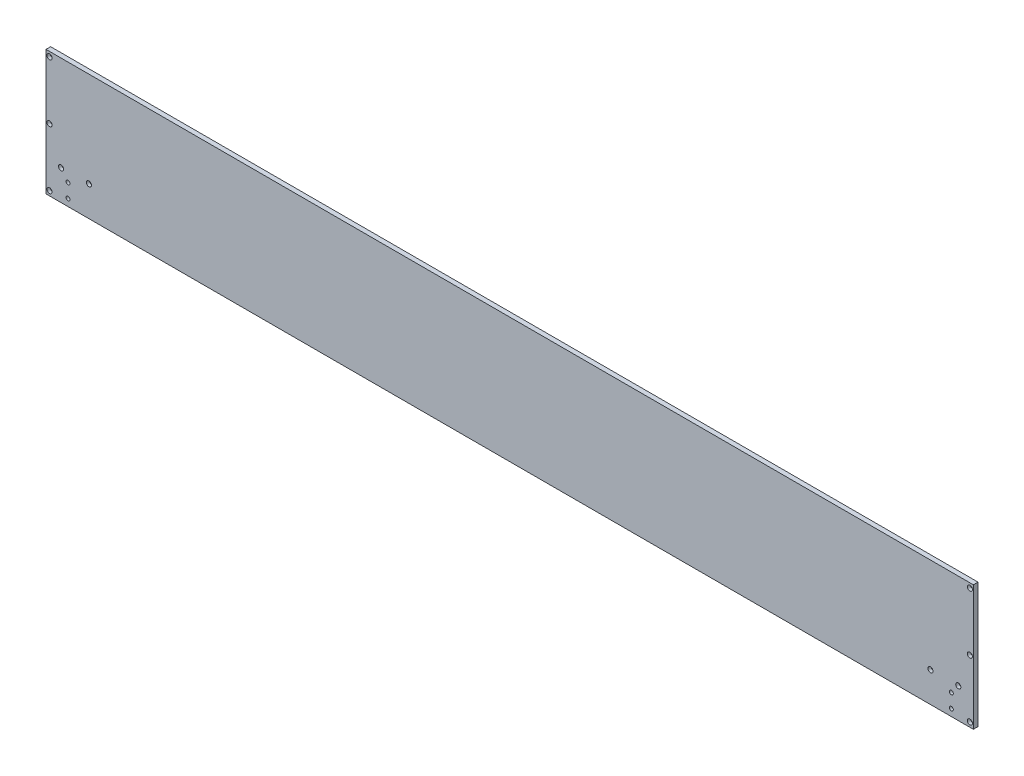
ISO-10303-21;
HEADER;
FILE_DESCRIPTION(('STEP AP214'),'2;1');
FILE_NAME('part.step','',(''),(''),'','','');
FILE_SCHEMA(('AUTOMOTIVE_DESIGN { 1 0 10303 214 1 1 1 1 }'));
ENDSEC;
DATA;
#1=APPLICATION_CONTEXT('core data for automotive mechanical design processes');
#2=APPLICATION_PROTOCOL_DEFINITION('international standard','automotive_design',2000,#1);
#3=PRODUCT_CONTEXT('',#1,'mechanical');
#4=PRODUCT('Part','Part','',(#3));
#5=PRODUCT_RELATED_PRODUCT_CATEGORY('part','',(#4));
#6=PRODUCT_DEFINITION_FORMATION('','',#4);
#7=PRODUCT_DEFINITION_CONTEXT('part definition',#1,'design');
#8=PRODUCT_DEFINITION('design','',#6,#7);
#9=PRODUCT_DEFINITION_SHAPE('','',#8);
#10=(LENGTH_UNIT() NAMED_UNIT(*) SI_UNIT(.MILLI.,.METRE.));
#11=(NAMED_UNIT(*) PLANE_ANGLE_UNIT() SI_UNIT($,.RADIAN.));
#12=(NAMED_UNIT(*) SI_UNIT($,.STERADIAN.) SOLID_ANGLE_UNIT());
#13=UNCERTAINTY_MEASURE_WITH_UNIT(LENGTH_MEASURE(1.E-05),#10,'distance_accuracy_value','');
#14=(GEOMETRIC_REPRESENTATION_CONTEXT(3) GLOBAL_UNCERTAINTY_ASSIGNED_CONTEXT((#13)) GLOBAL_UNIT_ASSIGNED_CONTEXT((#10,
#11,#12)) REPRESENTATION_CONTEXT('',''));
#15=CARTESIAN_POINT('',(0.,0.,0.));
#16=DIRECTION('',(0.,0.,1.));
#17=DIRECTION('',(1.,0.,0.));
#18=AXIS2_PLACEMENT_3D('',#15,#16,#17);
#19=CARTESIAN_POINT('',(0.,0.,5.));
#20=DIRECTION('',(0.,0.,-1.));
#21=DIRECTION('',(-1.,0.,0.));
#22=AXIS2_PLACEMENT_3D('',#19,#20,#21);
#23=PLANE('',#22);
#24=CARTESIAN_POINT('',(-967.5,-70.,5.));
#25=DIRECTION('',(0.,0.,1.));
#26=DIRECTION('',(1.,0.,0.));
#27=AXIS2_PLACEMENT_3D('',#24,#25,#26);
#28=CIRCLE('',#27,5.49999999999995);
#29=CARTESIAN_POINT('',(-962.,-70.,5.));
#30=VERTEX_POINT('',#29);
#31=EDGE_CURVE('E245',#30,#30,#28,.T.);
#32=ORIENTED_EDGE('',*,*,#31,.F.);
#33=EDGE_LOOP('',(#32));
#34=FACE_BOUND('',#33,.T.);
#35=CARTESIAN_POINT('',(907.5,-70.,5.));
#36=DIRECTION('',(0.,0.,1.));
#37=DIRECTION('',(1.,0.,0.));
#38=AXIS2_PLACEMENT_3D('',#35,#36,#37);
#39=CIRCLE('',#38,5.49999999999995);
#40=CARTESIAN_POINT('',(913.,-70.,5.));
#41=VERTEX_POINT('',#40);
#42=EDGE_CURVE('E233',#41,#41,#39,.T.);
#43=ORIENTED_EDGE('',*,*,#42,.F.);
#44=EDGE_LOOP('',(#43));
#45=FACE_BOUND('',#44,.T.);
#46=CARTESIAN_POINT('',(967.5,-70.,5.));
#47=DIRECTION('',(0.,0.,1.));
#48=DIRECTION('',(1.,0.,0.));
#49=AXIS2_PLACEMENT_3D('',#46,#47,#48);
#50=CIRCLE('',#49,5.49999999999995);
#51=CARTESIAN_POINT('',(973.,-70.,5.));
#52=VERTEX_POINT('',#51);
#53=EDGE_CURVE('E221',#52,#52,#50,.T.);
#54=ORIENTED_EDGE('',*,*,#53,.F.);
#55=EDGE_LOOP('',(#54));
#56=FACE_BOUND('',#55,.T.);
#57=CARTESIAN_POINT('',(952.5,-120.,5.));
#58=DIRECTION('',(0.,0.,1.));
#59=DIRECTION('',(1.,0.,0.));
#60=AXIS2_PLACEMENT_3D('',#57,#58,#59);
#61=CIRCLE('',#60,4.24999999999998);
#62=CARTESIAN_POINT('',(956.75,-120.,5.));
#63=VERTEX_POINT('',#62);
#64=EDGE_CURVE('E203',#63,#63,#61,.T.);
#65=ORIENTED_EDGE('',*,*,#64,.F.);
#66=EDGE_LOOP('',(#65));
#67=FACE_BOUND('',#66,.T.);
#68=CARTESIAN_POINT('',(-952.5,-90.,5.));
#69=DIRECTION('',(0.,0.,1.));
#70=DIRECTION('',(1.,0.,0.));
#71=AXIS2_PLACEMENT_3D('',#68,#69,#70);
#72=CIRCLE('',#71,4.24999999999998);
#73=CARTESIAN_POINT('',(-948.25,-90.,5.));
#74=VERTEX_POINT('',#73);
#75=EDGE_CURVE('E197',#74,#74,#72,.T.);
#76=ORIENTED_EDGE('',*,*,#75,.F.);
#77=EDGE_LOOP('',(#76));
#78=FACE_BOUND('',#77,.T.);
#79=CARTESIAN_POINT('',(-952.5,-120.,5.));
#80=DIRECTION('',(0.,0.,1.));
#81=DIRECTION('',(1.,0.,0.));
#82=AXIS2_PLACEMENT_3D('',#79,#80,#81);
#83=CIRCLE('',#82,4.24999999999998);
#84=CARTESIAN_POINT('',(-948.25,-120.,5.));
#85=VERTEX_POINT('',#84);
#86=EDGE_CURVE('E191',#85,#85,#83,.T.);
#87=ORIENTED_EDGE('',*,*,#86,.F.);
#88=EDGE_LOOP('',(#87));
#89=FACE_BOUND('',#88,.T.);
#90=CARTESIAN_POINT('',(-992.5,125.,5.));
#91=DIRECTION('',(0.,0.,1.));
#92=DIRECTION('',(1.,0.,0.));
#93=AXIS2_PLACEMENT_3D('',#90,#91,#92);
#94=CIRCLE('',#93,5.49999999999995);
#95=CARTESIAN_POINT('',(-987.,125.,5.));
#96=VERTEX_POINT('',#95);
#97=EDGE_CURVE('E185',#96,#96,#94,.T.);
#98=ORIENTED_EDGE('',*,*,#97,.F.);
#99=EDGE_LOOP('',(#98));
#100=FACE_BOUND('',#99,.T.);
#101=CARTESIAN_POINT('',(-992.5,-125.,5.));
#102=DIRECTION('',(0.,0.,1.));
#103=DIRECTION('',(1.,0.,0.));
#104=AXIS2_PLACEMENT_3D('',#101,#102,#103);
#105=CIRCLE('',#104,5.49999999999995);
#106=CARTESIAN_POINT('',(-987.,-125.,5.));
#107=VERTEX_POINT('',#106);
#108=EDGE_CURVE('E173',#107,#107,#105,.T.);
#109=ORIENTED_EDGE('',*,*,#108,.F.);
#110=EDGE_LOOP('',(#109));
#111=FACE_BOUND('',#110,.T.);
#112=CARTESIAN_POINT('',(992.5,125.,5.));
#113=DIRECTION('',(0.,0.,1.));
#114=DIRECTION('',(1.,0.,0.));
#115=AXIS2_PLACEMENT_3D('',#112,#113,#114);
#116=CIRCLE('',#115,5.49999999999995);
#117=CARTESIAN_POINT('',(998.,125.,5.));
#118=VERTEX_POINT('',#117);
#119=EDGE_CURVE('E161',#118,#118,#116,.T.);
#120=ORIENTED_EDGE('',*,*,#119,.F.);
#121=EDGE_LOOP('',(#120));
#122=FACE_BOUND('',#121,.T.);
#123=CARTESIAN_POINT('',(992.5,-125.,5.));
#124=DIRECTION('',(0.,0.,1.));
#125=DIRECTION('',(1.,0.,0.));
#126=AXIS2_PLACEMENT_3D('',#123,#124,#125);
#127=CIRCLE('',#126,5.49999999999995);
#128=CARTESIAN_POINT('',(998.,-125.,5.));
#129=VERTEX_POINT('',#128);
#130=EDGE_CURVE('E149',#129,#129,#127,.T.);
#131=ORIENTED_EDGE('',*,*,#130,.F.);
#132=EDGE_LOOP('',(#131));
#133=FACE_BOUND('',#132,.T.);
#134=CARTESIAN_POINT('',(992.5,0.,5.));
#135=DIRECTION('',(0.,0.,1.));
#136=DIRECTION('',(1.,0.,0.));
#137=AXIS2_PLACEMENT_3D('',#134,#135,#136);
#138=CIRCLE('',#137,5.49999999999995);
#139=CARTESIAN_POINT('',(997.999999999999,0.,5.));
#140=VERTEX_POINT('',#139);
#141=EDGE_CURVE('E137',#140,#140,#138,.T.);
#142=ORIENTED_EDGE('',*,*,#141,.F.);
#143=EDGE_LOOP('',(#142));
#144=FACE_BOUND('',#143,.T.);
#145=CARTESIAN_POINT('',(-992.5,0.,5.));
#146=DIRECTION('',(0.,0.,1.));
#147=DIRECTION('',(1.,0.,0.));
#148=AXIS2_PLACEMENT_3D('',#145,#146,#147);
#149=CIRCLE('',#148,5.49999999999995);
#150=CARTESIAN_POINT('',(-987.,0.,5.));
#151=VERTEX_POINT('',#150);
#152=EDGE_CURVE('E125',#151,#151,#149,.T.);
#153=ORIENTED_EDGE('',*,*,#152,.F.);
#154=EDGE_LOOP('',(#153));
#155=FACE_BOUND('',#154,.T.);
#156=DIRECTION('',(0.,1.,0.));
#157=VECTOR('',#156,1.);
#158=CARTESIAN_POINT('',(1000.,-135.,5.));
#159=LINE('',#158,#157);
#160=CARTESIAN_POINT('',(1000.,-135.,5.));
#161=VERTEX_POINT('',#160);
#162=CARTESIAN_POINT('',(1000.,135.,5.));
#163=VERTEX_POINT('',#162);
#164=EDGE_CURVE('E90',#161,#163,#159,.T.);
#165=ORIENTED_EDGE('',*,*,#164,.T.);
#166=DIRECTION('',(-1.,0.,0.));
#167=VECTOR('',#166,1.);
#168=CARTESIAN_POINT('',(-1000.,135.,5.));
#169=LINE('',#168,#167);
#170=CARTESIAN_POINT('',(-1000.,135.,5.));
#171=VERTEX_POINT('',#170);
#172=EDGE_CURVE('E85',#163,#171,#169,.T.);
#173=ORIENTED_EDGE('',*,*,#172,.T.);
#174=DIRECTION('',(0.,-1.,0.));
#175=VECTOR('',#174,1.);
#176=CARTESIAN_POINT('',(-1000.,-135.,5.));
#177=LINE('',#176,#175);
#178=CARTESIAN_POINT('',(-1000.,-135.,5.));
#179=VERTEX_POINT('',#178);
#180=EDGE_CURVE('E88',#171,#179,#177,.T.);
#181=ORIENTED_EDGE('',*,*,#180,.T.);
#182=DIRECTION('',(1.,0.,0.));
#183=VECTOR('',#182,1.);
#184=CARTESIAN_POINT('',(-1000.,-135.,5.));
#185=LINE('',#184,#183);
#186=EDGE_CURVE('E55',#179,#161,#185,.T.);
#187=ORIENTED_EDGE('',*,*,#186,.T.);
#188=EDGE_LOOP('',(#165,#173,#181,#187));
#189=FACE_BOUND('',#188,.T.);
#190=CARTESIAN_POINT('',(952.5,-90.,5.));
#191=DIRECTION('',(0.,0.,1.));
#192=DIRECTION('',(1.,0.,0.));
#193=AXIS2_PLACEMENT_3D('',#190,#191,#192);
#194=CIRCLE('',#193,4.24999999999998);
#195=CARTESIAN_POINT('',(956.75,-90.,5.));
#196=VERTEX_POINT('',#195);
#197=EDGE_CURVE('E209',#196,#196,#194,.T.);
#198=ORIENTED_EDGE('',*,*,#197,.F.);
#199=EDGE_LOOP('',(#198));
#200=FACE_BOUND('',#199,.T.);
#201=CARTESIAN_POINT('',(-907.5,-70.,5.));
#202=DIRECTION('',(0.,0.,1.));
#203=DIRECTION('',(1.,0.,0.));
#204=AXIS2_PLACEMENT_3D('',#201,#202,#203);
#205=CIRCLE('',#204,5.49999999999995);
#206=CARTESIAN_POINT('',(-902.,-70.,5.));
#207=VERTEX_POINT('',#206);
#208=EDGE_CURVE('E257',#207,#207,#205,.T.);
#209=ORIENTED_EDGE('',*,*,#208,.F.);
#210=EDGE_LOOP('',(#209));
#211=FACE_BOUND('',#210,.T.);
#212=ADVANCED_FACE('F38',(#34,#45,#56,#67,#78,#89,#100,#111,#122,#133,#144,#155,#189,#200,#211),
#23,.F.);
#213=CARTESIAN_POINT('',(0.,0.,-5.));
#214=DIRECTION('',(0.,0.,-1.));
#215=DIRECTION('',(-1.,0.,0.));
#216=AXIS2_PLACEMENT_3D('',#213,#214,#215);
#217=PLANE('',#216);
#218=CARTESIAN_POINT('',(-907.5,-70.,-5.));
#219=DIRECTION('',(0.,0.,1.));
#220=DIRECTION('',(1.,0.,0.));
#221=AXIS2_PLACEMENT_3D('',#218,#219,#220);
#222=CIRCLE('',#221,3.29999999999997);
#223=CARTESIAN_POINT('',(-904.2,-70.,-5.));
#224=VERTEX_POINT('',#223);
#225=EDGE_CURVE('E248',#224,#224,#222,.T.);
#226=ORIENTED_EDGE('',*,*,#225,.T.);
#227=EDGE_LOOP('',(#226));
#228=FACE_BOUND('',#227,.T.);
#229=CARTESIAN_POINT('',(952.5,-120.,-5.));
#230=DIRECTION('',(0.,0.,1.));
#231=DIRECTION('',(1.,0.,0.));
#232=AXIS2_PLACEMENT_3D('',#229,#230,#231);
#233=CIRCLE('',#232,4.24999999999998);
#234=CARTESIAN_POINT('',(956.75,-120.,-5.));
#235=VERTEX_POINT('',#234);
#236=EDGE_CURVE('E200',#235,#235,#233,.T.);
#237=ORIENTED_EDGE('',*,*,#236,.T.);
#238=EDGE_LOOP('',(#237));
#239=FACE_BOUND('',#238,.T.);
#240=CARTESIAN_POINT('',(-952.5,-90.,-5.));
#241=DIRECTION('',(0.,0.,1.));
#242=DIRECTION('',(1.,0.,0.));
#243=AXIS2_PLACEMENT_3D('',#240,#241,#242);
#244=CIRCLE('',#243,4.24999999999998);
#245=CARTESIAN_POINT('',(-948.25,-90.,-5.));
#246=VERTEX_POINT('',#245);
#247=EDGE_CURVE('E194',#246,#246,#244,.T.);
#248=ORIENTED_EDGE('',*,*,#247,.T.);
#249=EDGE_LOOP('',(#248));
#250=FACE_BOUND('',#249,.T.);
#251=CARTESIAN_POINT('',(-952.5,-120.,-5.));
#252=DIRECTION('',(0.,0.,1.));
#253=DIRECTION('',(1.,0.,0.));
#254=AXIS2_PLACEMENT_3D('',#251,#252,#253);
#255=CIRCLE('',#254,4.24999999999998);
#256=CARTESIAN_POINT('',(-948.25,-120.,-5.));
#257=VERTEX_POINT('',#256);
#258=EDGE_CURVE('E188',#257,#257,#255,.T.);
#259=ORIENTED_EDGE('',*,*,#258,.T.);
#260=EDGE_LOOP('',(#259));
#261=FACE_BOUND('',#260,.T.);
#262=CARTESIAN_POINT('',(-992.5,125.,-5.));
#263=DIRECTION('',(0.,0.,1.));
#264=DIRECTION('',(1.,0.,0.));
#265=AXIS2_PLACEMENT_3D('',#262,#263,#264);
#266=CIRCLE('',#265,3.29999999999997);
#267=CARTESIAN_POINT('',(-989.2,125.,-5.));
#268=VERTEX_POINT('',#267);
#269=EDGE_CURVE('E176',#268,#268,#266,.T.);
#270=ORIENTED_EDGE('',*,*,#269,.T.);
#271=EDGE_LOOP('',(#270));
#272=FACE_BOUND('',#271,.T.);
#273=CARTESIAN_POINT('',(-992.5,-125.,-5.));
#274=DIRECTION('',(0.,0.,1.));
#275=DIRECTION('',(1.,0.,0.));
#276=AXIS2_PLACEMENT_3D('',#273,#274,#275);
#277=CIRCLE('',#276,3.29999999999997);
#278=CARTESIAN_POINT('',(-989.2,-125.,-5.));
#279=VERTEX_POINT('',#278);
#280=EDGE_CURVE('E164',#279,#279,#277,.T.);
#281=ORIENTED_EDGE('',*,*,#280,.T.);
#282=EDGE_LOOP('',(#281));
#283=FACE_BOUND('',#282,.T.);
#284=CARTESIAN_POINT('',(992.5,125.,-5.));
#285=DIRECTION('',(0.,0.,1.));
#286=DIRECTION('',(1.,0.,0.));
#287=AXIS2_PLACEMENT_3D('',#284,#285,#286);
#288=CIRCLE('',#287,3.29999999999997);
#289=CARTESIAN_POINT('',(995.8,125.,-5.));
#290=VERTEX_POINT('',#289);
#291=EDGE_CURVE('E152',#290,#290,#288,.T.);
#292=ORIENTED_EDGE('',*,*,#291,.T.);
#293=EDGE_LOOP('',(#292));
#294=FACE_BOUND('',#293,.T.);
#295=CARTESIAN_POINT('',(992.5,-125.,-5.));
#296=DIRECTION('',(0.,0.,1.));
#297=DIRECTION('',(1.,0.,0.));
#298=AXIS2_PLACEMENT_3D('',#295,#296,#297);
#299=CIRCLE('',#298,3.29999999999997);
#300=CARTESIAN_POINT('',(995.8,-125.,-5.));
#301=VERTEX_POINT('',#300);
#302=EDGE_CURVE('E140',#301,#301,#299,.T.);
#303=ORIENTED_EDGE('',*,*,#302,.T.);
#304=EDGE_LOOP('',(#303));
#305=FACE_BOUND('',#304,.T.);
#306=CARTESIAN_POINT('',(992.5,0.,-5.));
#307=DIRECTION('',(0.,0.,1.));
#308=DIRECTION('',(1.,0.,0.));
#309=AXIS2_PLACEMENT_3D('',#306,#307,#308);
#310=CIRCLE('',#309,3.29999999999997);
#311=CARTESIAN_POINT('',(995.799999999999,0.,-5.));
#312=VERTEX_POINT('',#311);
#313=EDGE_CURVE('E128',#312,#312,#310,.T.);
#314=ORIENTED_EDGE('',*,*,#313,.T.);
#315=EDGE_LOOP('',(#314));
#316=FACE_BOUND('',#315,.T.);
#317=CARTESIAN_POINT('',(-992.5,0.,-5.));
#318=DIRECTION('',(0.,0.,1.));
#319=DIRECTION('',(1.,0.,0.));
#320=AXIS2_PLACEMENT_3D('',#317,#318,#319);
#321=CIRCLE('',#320,3.29999999999997);
#322=CARTESIAN_POINT('',(-989.2,0.,-5.));
#323=VERTEX_POINT('',#322);
#324=EDGE_CURVE('E105',#323,#323,#321,.T.);
#325=ORIENTED_EDGE('',*,*,#324,.T.);
#326=EDGE_LOOP('',(#325));
#327=FACE_BOUND('',#326,.T.);
#328=DIRECTION('',(0.,1.,0.));
#329=VECTOR('',#328,1.);
#330=CARTESIAN_POINT('',(1000.,-135.,-5.));
#331=LINE('',#330,#329);
#332=CARTESIAN_POINT('',(1000.,-135.,-5.));
#333=VERTEX_POINT('',#332);
#334=CARTESIAN_POINT('',(1000.,135.,-5.));
#335=VERTEX_POINT('',#334);
#336=EDGE_CURVE('E102',#333,#335,#331,.T.);
#337=ORIENTED_EDGE('',*,*,#336,.F.);
#338=DIRECTION('',(1.,0.,0.));
#339=VECTOR('',#338,1.);
#340=CARTESIAN_POINT('',(-1000.,-135.,-5.));
#341=LINE('',#340,#339);
#342=CARTESIAN_POINT('',(-1000.,-135.,-5.));
#343=VERTEX_POINT('',#342);
#344=EDGE_CURVE('E78',#343,#333,#341,.T.);
#345=ORIENTED_EDGE('',*,*,#344,.F.);
#346=DIRECTION('',(0.,-1.,0.));
#347=VECTOR('',#346,1.);
#348=CARTESIAN_POINT('',(-1000.,-135.,-5.));
#349=LINE('',#348,#347);
#350=CARTESIAN_POINT('',(-1000.,135.,-5.));
#351=VERTEX_POINT('',#350);
#352=EDGE_CURVE('E72',#351,#343,#349,.T.);
#353=ORIENTED_EDGE('',*,*,#352,.F.);
#354=DIRECTION('',(-1.,0.,0.));
#355=VECTOR('',#354,1.);
#356=CARTESIAN_POINT('',(-1000.,135.,-5.));
#357=LINE('',#356,#355);
#358=EDGE_CURVE('E94',#335,#351,#357,.T.);
#359=ORIENTED_EDGE('',*,*,#358,.F.);
#360=EDGE_LOOP('',(#337,#345,#353,#359));
#361=FACE_BOUND('',#360,.T.);
#362=CARTESIAN_POINT('',(952.5,-90.,-5.));
#363=DIRECTION('',(0.,0.,1.));
#364=DIRECTION('',(1.,0.,0.));
#365=AXIS2_PLACEMENT_3D('',#362,#363,#364);
#366=CIRCLE('',#365,4.24999999999998);
#367=CARTESIAN_POINT('',(956.75,-90.,-5.));
#368=VERTEX_POINT('',#367);
#369=EDGE_CURVE('E206',#368,#368,#366,.T.);
#370=ORIENTED_EDGE('',*,*,#369,.T.);
#371=EDGE_LOOP('',(#370));
#372=FACE_BOUND('',#371,.T.);
#373=CARTESIAN_POINT('',(967.5,-70.,-5.));
#374=DIRECTION('',(0.,0.,1.));
#375=DIRECTION('',(1.,0.,0.));
#376=AXIS2_PLACEMENT_3D('',#373,#374,#375);
#377=CIRCLE('',#376,3.29999999999997);
#378=CARTESIAN_POINT('',(970.8,-70.,-5.));
#379=VERTEX_POINT('',#378);
#380=EDGE_CURVE('E212',#379,#379,#377,.T.);
#381=ORIENTED_EDGE('',*,*,#380,.T.);
#382=EDGE_LOOP('',(#381));
#383=FACE_BOUND('',#382,.T.);
#384=CARTESIAN_POINT('',(907.5,-70.,-5.));
#385=DIRECTION('',(0.,0.,1.));
#386=DIRECTION('',(1.,0.,0.));
#387=AXIS2_PLACEMENT_3D('',#384,#385,#386);
#388=CIRCLE('',#387,3.29999999999997);
#389=CARTESIAN_POINT('',(910.8,-70.,-5.));
#390=VERTEX_POINT('',#389);
#391=EDGE_CURVE('E224',#390,#390,#388,.T.);
#392=ORIENTED_EDGE('',*,*,#391,.T.);
#393=EDGE_LOOP('',(#392));
#394=FACE_BOUND('',#393,.T.);
#395=CARTESIAN_POINT('',(-967.5,-70.,-5.));
#396=DIRECTION('',(0.,0.,1.));
#397=DIRECTION('',(1.,0.,0.));
#398=AXIS2_PLACEMENT_3D('',#395,#396,#397);
#399=CIRCLE('',#398,3.29999999999997);
#400=CARTESIAN_POINT('',(-964.2,-70.,-5.));
#401=VERTEX_POINT('',#400);
#402=EDGE_CURVE('E236',#401,#401,#399,.T.);
#403=ORIENTED_EDGE('',*,*,#402,.T.);
#404=EDGE_LOOP('',(#403));
#405=FACE_BOUND('',#404,.T.);
#406=ADVANCED_FACE('F113',(#228,#239,#250,#261,#272,#283,#294,#305,#316,#327,#361,#372,#383,
#394,#405),#217,.T.);
#407=CARTESIAN_POINT('',(1000.,-135.,5.));
#408=DIRECTION('',(-1.,0.,0.));
#409=DIRECTION('',(0.,0.,1.));
#410=AXIS2_PLACEMENT_3D('',#407,#408,#409);
#411=PLANE('',#410);
#412=ORIENTED_EDGE('',*,*,#336,.T.);
#413=DIRECTION('',(0.,0.,-1.));
#414=VECTOR('',#413,1.);
#415=CARTESIAN_POINT('',(1000.,135.,5.));
#416=LINE('',#415,#414);
#417=EDGE_CURVE('E11',#163,#335,#416,.T.);
#418=ORIENTED_EDGE('',*,*,#417,.F.);
#419=ORIENTED_EDGE('',*,*,#164,.F.);
#420=DIRECTION('',(0.,0.,-1.));
#421=VECTOR('',#420,1.);
#422=CARTESIAN_POINT('',(1000.,-135.,5.));
#423=LINE('',#422,#421);
#424=EDGE_CURVE('E98',#161,#333,#423,.T.);
#425=ORIENTED_EDGE('',*,*,#424,.T.);
#426=EDGE_LOOP('',(#412,#418,#419,#425));
#427=FACE_BOUND('',#426,.T.);
#428=ADVANCED_FACE('F40',(#427),#411,.F.);
#429=CARTESIAN_POINT('',(-1000.,135.,5.));
#430=DIRECTION('',(0.,-1.,0.));
#431=DIRECTION('',(0.,0.,-1.));
#432=AXIS2_PLACEMENT_3D('',#429,#430,#431);
#433=PLANE('',#432);
#434=ORIENTED_EDGE('',*,*,#358,.T.);
#435=DIRECTION('',(0.,0.,-1.));
#436=VECTOR('',#435,1.);
#437=CARTESIAN_POINT('',(-1000.,135.,5.));
#438=LINE('',#437,#436);
#439=EDGE_CURVE('E47',#171,#351,#438,.T.);
#440=ORIENTED_EDGE('',*,*,#439,.F.);
#441=ORIENTED_EDGE('',*,*,#172,.F.);
#442=ORIENTED_EDGE('',*,*,#417,.T.);
#443=EDGE_LOOP('',(#434,#440,#441,#442));
#444=FACE_BOUND('',#443,.T.);
#445=ADVANCED_FACE('F93',(#444),#433,.F.);
#446=CARTESIAN_POINT('',(-1000.,-135.,5.));
#447=DIRECTION('',(1.,0.,0.));
#448=DIRECTION('',(0.,0.,-1.));
#449=AXIS2_PLACEMENT_3D('',#446,#447,#448);
#450=PLANE('',#449);
#451=ORIENTED_EDGE('',*,*,#352,.T.);
#452=DIRECTION('',(0.,0.,-1.));
#453=VECTOR('',#452,1.);
#454=CARTESIAN_POINT('',(-1000.,-135.,5.));
#455=LINE('',#454,#453);
#456=EDGE_CURVE('E95',#179,#343,#455,.T.);
#457=ORIENTED_EDGE('',*,*,#456,.F.);
#458=ORIENTED_EDGE('',*,*,#180,.F.);
#459=ORIENTED_EDGE('',*,*,#439,.T.);
#460=EDGE_LOOP('',(#451,#457,#458,#459));
#461=FACE_BOUND('',#460,.T.);
#462=ADVANCED_FACE('F96',(#461),#450,.F.);
#463=CARTESIAN_POINT('',(-1000.,-135.,5.));
#464=DIRECTION('',(0.,1.,0.));
#465=DIRECTION('',(0.,0.,1.));
#466=AXIS2_PLACEMENT_3D('',#463,#464,#465);
#467=PLANE('',#466);
#468=ORIENTED_EDGE('',*,*,#344,.T.);
#469=ORIENTED_EDGE('',*,*,#424,.F.);
#470=ORIENTED_EDGE('',*,*,#186,.F.);
#471=ORIENTED_EDGE('',*,*,#456,.T.);
#472=EDGE_LOOP('',(#468,#469,#470,#471));
#473=FACE_BOUND('',#472,.T.);
#474=ADVANCED_FACE('F110',(#473),#467,.F.);
#475=CARTESIAN_POINT('',(-992.5,0.,5.));
#476=DIRECTION('',(0.,0.,1.));
#477=DIRECTION('',(1.,0.,0.));
#478=AXIS2_PLACEMENT_3D('',#475,#476,#477);
#479=CYLINDRICAL_SURFACE('',#478,3.29999999999997);
#480=ORIENTED_EDGE('',*,*,#324,.F.);
#481=EDGE_LOOP('',(#480));
#482=FACE_BOUND('',#481,.T.);
#483=CARTESIAN_POINT('',(-992.5,0.,-1.8));
#484=DIRECTION('',(0.,0.,1.));
#485=DIRECTION('',(1.,0.,0.));
#486=AXIS2_PLACEMENT_3D('',#483,#484,#485);
#487=CIRCLE('',#486,3.29999999999997);
#488=CARTESIAN_POINT('',(-989.2,0.,-1.8));
#489=VERTEX_POINT('',#488);
#490=EDGE_CURVE('E119',#489,#489,#487,.T.);
#491=ORIENTED_EDGE('',*,*,#490,.T.);
#492=EDGE_LOOP('',(#491));
#493=FACE_BOUND('',#492,.T.);
#494=ADVANCED_FACE('F275',(#482,#493),#479,.F.);
#495=CARTESIAN_POINT('',(-989.2,0.,-1.8));
#496=DIRECTION('',(0.,0.,-1.));
#497=DIRECTION('',(-1.,0.,0.));
#498=AXIS2_PLACEMENT_3D('',#495,#496,#497);
#499=PLANE('',#498);
#500=ORIENTED_EDGE('',*,*,#490,.F.);
#501=EDGE_LOOP('',(#500));
#502=FACE_BOUND('',#501,.T.);
#503=CARTESIAN_POINT('',(-992.5,0.,-1.8));
#504=DIRECTION('',(0.,0.,1.));
#505=DIRECTION('',(1.,0.,0.));
#506=AXIS2_PLACEMENT_3D('',#503,#504,#505);
#507=CIRCLE('',#506,5.49999999999995);
#508=CARTESIAN_POINT('',(-987.,0.,-1.8));
#509=VERTEX_POINT('',#508);
#510=EDGE_CURVE('E122',#509,#509,#507,.T.);
#511=ORIENTED_EDGE('',*,*,#510,.T.);
#512=EDGE_LOOP('',(#511));
#513=FACE_BOUND('',#512,.T.);
#514=ADVANCED_FACE('F312',(#502,#513),#499,.F.);
#515=CARTESIAN_POINT('',(-992.5,0.,5.));
#516=DIRECTION('',(0.,0.,1.));
#517=DIRECTION('',(1.,0.,0.));
#518=AXIS2_PLACEMENT_3D('',#515,#516,#517);
#519=CYLINDRICAL_SURFACE('',#518,5.49999999999995);
#520=ORIENTED_EDGE('',*,*,#510,.F.);
#521=EDGE_LOOP('',(#520));
#522=FACE_BOUND('',#521,.T.);
#523=ORIENTED_EDGE('',*,*,#152,.T.);
#524=EDGE_LOOP('',(#523));
#525=FACE_BOUND('',#524,.T.);
#526=ADVANCED_FACE('F321',(#522,#525),#519,.F.);
#527=CARTESIAN_POINT('',(992.5,0.,5.));
#528=DIRECTION('',(0.,0.,1.));
#529=DIRECTION('',(1.,0.,0.));
#530=AXIS2_PLACEMENT_3D('',#527,#528,#529);
#531=CYLINDRICAL_SURFACE('',#530,3.29999999999997);
#532=ORIENTED_EDGE('',*,*,#313,.F.);
#533=EDGE_LOOP('',(#532));
#534=FACE_BOUND('',#533,.T.);
#535=CARTESIAN_POINT('',(992.5,0.,-1.8));
#536=DIRECTION('',(0.,0.,1.));
#537=DIRECTION('',(1.,0.,0.));
#538=AXIS2_PLACEMENT_3D('',#535,#536,#537);
#539=CIRCLE('',#538,3.29999999999997);
#540=CARTESIAN_POINT('',(995.799999999999,0.,-1.8));
#541=VERTEX_POINT('',#540);
#542=EDGE_CURVE('E131',#541,#541,#539,.T.);
#543=ORIENTED_EDGE('',*,*,#542,.T.);
#544=EDGE_LOOP('',(#543));
#545=FACE_BOUND('',#544,.T.);
#546=ADVANCED_FACE('F330',(#534,#545),#531,.F.);
#547=CARTESIAN_POINT('',(995.799999999999,0.,-1.8));
#548=DIRECTION('',(0.,0.,-1.));
#549=DIRECTION('',(-1.,0.,0.));
#550=AXIS2_PLACEMENT_3D('',#547,#548,#549);
#551=PLANE('',#550);
#552=ORIENTED_EDGE('',*,*,#542,.F.);
#553=EDGE_LOOP('',(#552));
#554=FACE_BOUND('',#553,.T.);
#555=CARTESIAN_POINT('',(992.5,0.,-1.8));
#556=DIRECTION('',(0.,0.,1.));
#557=DIRECTION('',(1.,0.,0.));
#558=AXIS2_PLACEMENT_3D('',#555,#556,#557);
#559=CIRCLE('',#558,5.49999999999995);
#560=CARTESIAN_POINT('',(997.999999999999,0.,-1.8));
#561=VERTEX_POINT('',#560);
#562=EDGE_CURVE('E134',#561,#561,#559,.T.);
#563=ORIENTED_EDGE('',*,*,#562,.T.);
#564=EDGE_LOOP('',(#563));
#565=FACE_BOUND('',#564,.T.);
#566=ADVANCED_FACE('F340',(#554,#565),#551,.F.);
#567=CARTESIAN_POINT('',(992.5,0.,5.));
#568=DIRECTION('',(0.,0.,1.));
#569=DIRECTION('',(1.,0.,0.));
#570=AXIS2_PLACEMENT_3D('',#567,#568,#569);
#571=CYLINDRICAL_SURFACE('',#570,5.49999999999995);
#572=ORIENTED_EDGE('',*,*,#562,.F.);
#573=EDGE_LOOP('',(#572));
#574=FACE_BOUND('',#573,.T.);
#575=ORIENTED_EDGE('',*,*,#141,.T.);
#576=EDGE_LOOP('',(#575));
#577=FACE_BOUND('',#576,.T.);
#578=ADVANCED_FACE('F350',(#574,#577),#571,.F.);
#579=CARTESIAN_POINT('',(992.5,-125.,5.));
#580=DIRECTION('',(0.,0.,1.));
#581=DIRECTION('',(1.,0.,0.));
#582=AXIS2_PLACEMENT_3D('',#579,#580,#581);
#583=CYLINDRICAL_SURFACE('',#582,3.29999999999997);
#584=ORIENTED_EDGE('',*,*,#302,.F.);
#585=EDGE_LOOP('',(#584));
#586=FACE_BOUND('',#585,.T.);
#587=CARTESIAN_POINT('',(992.5,-125.,-1.8));
#588=DIRECTION('',(0.,0.,1.));
#589=DIRECTION('',(1.,0.,0.));
#590=AXIS2_PLACEMENT_3D('',#587,#588,#589);
#591=CIRCLE('',#590,3.29999999999997);
#592=CARTESIAN_POINT('',(995.8,-125.,-1.8));
#593=VERTEX_POINT('',#592);
#594=EDGE_CURVE('E143',#593,#593,#591,.T.);
#595=ORIENTED_EDGE('',*,*,#594,.T.);
#596=EDGE_LOOP('',(#595));
#597=FACE_BOUND('',#596,.T.);
#598=ADVANCED_FACE('F360',(#586,#597),#583,.F.);
#599=CARTESIAN_POINT('',(995.8,-125.,-1.8));
#600=DIRECTION('',(0.,0.,-1.));
#601=DIRECTION('',(-1.,0.,0.));
#602=AXIS2_PLACEMENT_3D('',#599,#600,#601);
#603=PLANE('',#602);
#604=ORIENTED_EDGE('',*,*,#594,.F.);
#605=EDGE_LOOP('',(#604));
#606=FACE_BOUND('',#605,.T.);
#607=CARTESIAN_POINT('',(992.5,-125.,-1.8));
#608=DIRECTION('',(0.,0.,1.));
#609=DIRECTION('',(1.,0.,0.));
#610=AXIS2_PLACEMENT_3D('',#607,#608,#609);
#611=CIRCLE('',#610,5.49999999999995);
#612=CARTESIAN_POINT('',(998.,-125.,-1.8));
#613=VERTEX_POINT('',#612);
#614=EDGE_CURVE('E146',#613,#613,#611,.T.);
#615=ORIENTED_EDGE('',*,*,#614,.T.);
#616=EDGE_LOOP('',(#615));
#617=FACE_BOUND('',#616,.T.);
#618=ADVANCED_FACE('F370',(#606,#617),#603,.F.);
#619=CARTESIAN_POINT('',(992.5,-125.,5.));
#620=DIRECTION('',(0.,0.,1.));
#621=DIRECTION('',(1.,0.,0.));
#622=AXIS2_PLACEMENT_3D('',#619,#620,#621);
#623=CYLINDRICAL_SURFACE('',#622,5.49999999999995);
#624=ORIENTED_EDGE('',*,*,#614,.F.);
#625=EDGE_LOOP('',(#624));
#626=FACE_BOUND('',#625,.T.);
#627=ORIENTED_EDGE('',*,*,#130,.T.);
#628=EDGE_LOOP('',(#627));
#629=FACE_BOUND('',#628,.T.);
#630=ADVANCED_FACE('F380',(#626,#629),#623,.F.);
#631=CARTESIAN_POINT('',(992.5,125.,5.));
#632=DIRECTION('',(0.,0.,1.));
#633=DIRECTION('',(1.,0.,0.));
#634=AXIS2_PLACEMENT_3D('',#631,#632,#633);
#635=CYLINDRICAL_SURFACE('',#634,3.29999999999997);
#636=ORIENTED_EDGE('',*,*,#291,.F.);
#637=EDGE_LOOP('',(#636));
#638=FACE_BOUND('',#637,.T.);
#639=CARTESIAN_POINT('',(992.5,125.,-1.8));
#640=DIRECTION('',(0.,0.,1.));
#641=DIRECTION('',(1.,0.,0.));
#642=AXIS2_PLACEMENT_3D('',#639,#640,#641);
#643=CIRCLE('',#642,3.29999999999997);
#644=CARTESIAN_POINT('',(995.8,125.,-1.8));
#645=VERTEX_POINT('',#644);
#646=EDGE_CURVE('E155',#645,#645,#643,.T.);
#647=ORIENTED_EDGE('',*,*,#646,.T.);
#648=EDGE_LOOP('',(#647));
#649=FACE_BOUND('',#648,.T.);
#650=ADVANCED_FACE('F390',(#638,#649),#635,.F.);
#651=CARTESIAN_POINT('',(995.8,125.,-1.8));
#652=DIRECTION('',(0.,0.,-1.));
#653=DIRECTION('',(-1.,0.,0.));
#654=AXIS2_PLACEMENT_3D('',#651,#652,#653);
#655=PLANE('',#654);
#656=ORIENTED_EDGE('',*,*,#646,.F.);
#657=EDGE_LOOP('',(#656));
#658=FACE_BOUND('',#657,.T.);
#659=CARTESIAN_POINT('',(992.5,125.,-1.8));
#660=DIRECTION('',(0.,0.,1.));
#661=DIRECTION('',(1.,0.,0.));
#662=AXIS2_PLACEMENT_3D('',#659,#660,#661);
#663=CIRCLE('',#662,5.49999999999995);
#664=CARTESIAN_POINT('',(998.,125.,-1.8));
#665=VERTEX_POINT('',#664);
#666=EDGE_CURVE('E158',#665,#665,#663,.T.);
#667=ORIENTED_EDGE('',*,*,#666,.T.);
#668=EDGE_LOOP('',(#667));
#669=FACE_BOUND('',#668,.T.);
#670=ADVANCED_FACE('F400',(#658,#669),#655,.F.);
#671=CARTESIAN_POINT('',(992.5,125.,5.));
#672=DIRECTION('',(0.,0.,1.));
#673=DIRECTION('',(1.,0.,0.));
#674=AXIS2_PLACEMENT_3D('',#671,#672,#673);
#675=CYLINDRICAL_SURFACE('',#674,5.49999999999995);
#676=ORIENTED_EDGE('',*,*,#666,.F.);
#677=EDGE_LOOP('',(#676));
#678=FACE_BOUND('',#677,.T.);
#679=ORIENTED_EDGE('',*,*,#119,.T.);
#680=EDGE_LOOP('',(#679));
#681=FACE_BOUND('',#680,.T.);
#682=ADVANCED_FACE('F410',(#678,#681),#675,.F.);
#683=CARTESIAN_POINT('',(-992.5,-125.,5.));
#684=DIRECTION('',(0.,0.,1.));
#685=DIRECTION('',(1.,0.,0.));
#686=AXIS2_PLACEMENT_3D('',#683,#684,#685);
#687=CYLINDRICAL_SURFACE('',#686,3.29999999999997);
#688=ORIENTED_EDGE('',*,*,#280,.F.);
#689=EDGE_LOOP('',(#688));
#690=FACE_BOUND('',#689,.T.);
#691=CARTESIAN_POINT('',(-992.5,-125.,-1.8));
#692=DIRECTION('',(0.,0.,1.));
#693=DIRECTION('',(1.,0.,0.));
#694=AXIS2_PLACEMENT_3D('',#691,#692,#693);
#695=CIRCLE('',#694,3.29999999999997);
#696=CARTESIAN_POINT('',(-989.2,-125.,-1.8));
#697=VERTEX_POINT('',#696);
#698=EDGE_CURVE('E167',#697,#697,#695,.T.);
#699=ORIENTED_EDGE('',*,*,#698,.T.);
#700=EDGE_LOOP('',(#699));
#701=FACE_BOUND('',#700,.T.);
#702=ADVANCED_FACE('F420',(#690,#701),#687,.F.);
#703=CARTESIAN_POINT('',(-989.2,-125.,-1.8));
#704=DIRECTION('',(0.,0.,-1.));
#705=DIRECTION('',(-1.,0.,0.));
#706=AXIS2_PLACEMENT_3D('',#703,#704,#705);
#707=PLANE('',#706);
#708=ORIENTED_EDGE('',*,*,#698,.F.);
#709=EDGE_LOOP('',(#708));
#710=FACE_BOUND('',#709,.T.);
#711=CARTESIAN_POINT('',(-992.5,-125.,-1.8));
#712=DIRECTION('',(0.,0.,1.));
#713=DIRECTION('',(1.,0.,0.));
#714=AXIS2_PLACEMENT_3D('',#711,#712,#713);
#715=CIRCLE('',#714,5.49999999999995);
#716=CARTESIAN_POINT('',(-987.,-125.,-1.8));
#717=VERTEX_POINT('',#716);
#718=EDGE_CURVE('E170',#717,#717,#715,.T.);
#719=ORIENTED_EDGE('',*,*,#718,.T.);
#720=EDGE_LOOP('',(#719));
#721=FACE_BOUND('',#720,.T.);
#722=ADVANCED_FACE('F430',(#710,#721),#707,.F.);
#723=CARTESIAN_POINT('',(-992.5,-125.,5.));
#724=DIRECTION('',(0.,0.,1.));
#725=DIRECTION('',(1.,0.,0.));
#726=AXIS2_PLACEMENT_3D('',#723,#724,#725);
#727=CYLINDRICAL_SURFACE('',#726,5.49999999999995);
#728=ORIENTED_EDGE('',*,*,#718,.F.);
#729=EDGE_LOOP('',(#728));
#730=FACE_BOUND('',#729,.T.);
#731=ORIENTED_EDGE('',*,*,#108,.T.);
#732=EDGE_LOOP('',(#731));
#733=FACE_BOUND('',#732,.T.);
#734=ADVANCED_FACE('F440',(#730,#733),#727,.F.);
#735=CARTESIAN_POINT('',(-992.5,125.,5.));
#736=DIRECTION('',(0.,0.,1.));
#737=DIRECTION('',(1.,0.,0.));
#738=AXIS2_PLACEMENT_3D('',#735,#736,#737);
#739=CYLINDRICAL_SURFACE('',#738,3.29999999999997);
#740=ORIENTED_EDGE('',*,*,#269,.F.);
#741=EDGE_LOOP('',(#740));
#742=FACE_BOUND('',#741,.T.);
#743=CARTESIAN_POINT('',(-992.5,125.,-1.8));
#744=DIRECTION('',(0.,0.,1.));
#745=DIRECTION('',(1.,0.,0.));
#746=AXIS2_PLACEMENT_3D('',#743,#744,#745);
#747=CIRCLE('',#746,3.29999999999997);
#748=CARTESIAN_POINT('',(-989.2,125.,-1.8));
#749=VERTEX_POINT('',#748);
#750=EDGE_CURVE('E179',#749,#749,#747,.T.);
#751=ORIENTED_EDGE('',*,*,#750,.T.);
#752=EDGE_LOOP('',(#751));
#753=FACE_BOUND('',#752,.T.);
#754=ADVANCED_FACE('F450',(#742,#753),#739,.F.);
#755=CARTESIAN_POINT('',(-989.2,125.,-1.8));
#756=DIRECTION('',(0.,0.,-1.));
#757=DIRECTION('',(-1.,0.,0.));
#758=AXIS2_PLACEMENT_3D('',#755,#756,#757);
#759=PLANE('',#758);
#760=ORIENTED_EDGE('',*,*,#750,.F.);
#761=EDGE_LOOP('',(#760));
#762=FACE_BOUND('',#761,.T.);
#763=CARTESIAN_POINT('',(-992.5,125.,-1.8));
#764=DIRECTION('',(0.,0.,1.));
#765=DIRECTION('',(1.,0.,0.));
#766=AXIS2_PLACEMENT_3D('',#763,#764,#765);
#767=CIRCLE('',#766,5.49999999999995);
#768=CARTESIAN_POINT('',(-987.,125.,-1.8));
#769=VERTEX_POINT('',#768);
#770=EDGE_CURVE('E182',#769,#769,#767,.T.);
#771=ORIENTED_EDGE('',*,*,#770,.T.);
#772=EDGE_LOOP('',(#771));
#773=FACE_BOUND('',#772,.T.);
#774=ADVANCED_FACE('F460',(#762,#773),#759,.F.);
#775=CARTESIAN_POINT('',(-992.5,125.,5.));
#776=DIRECTION('',(0.,0.,1.));
#777=DIRECTION('',(1.,0.,0.));
#778=AXIS2_PLACEMENT_3D('',#775,#776,#777);
#779=CYLINDRICAL_SURFACE('',#778,5.49999999999995);
#780=ORIENTED_EDGE('',*,*,#770,.F.);
#781=EDGE_LOOP('',(#780));
#782=FACE_BOUND('',#781,.T.);
#783=ORIENTED_EDGE('',*,*,#97,.T.);
#784=EDGE_LOOP('',(#783));
#785=FACE_BOUND('',#784,.T.);
#786=ADVANCED_FACE('F470',(#782,#785),#779,.F.);
#787=CARTESIAN_POINT('',(-952.5,-120.,5.));
#788=DIRECTION('',(0.,0.,1.));
#789=DIRECTION('',(1.,0.,0.));
#790=AXIS2_PLACEMENT_3D('',#787,#788,#789);
#791=CYLINDRICAL_SURFACE('',#790,4.24999999999998);
#792=ORIENTED_EDGE('',*,*,#258,.F.);
#793=EDGE_LOOP('',(#792));
#794=FACE_BOUND('',#793,.T.);
#795=ORIENTED_EDGE('',*,*,#86,.T.);
#796=EDGE_LOOP('',(#795));
#797=FACE_BOUND('',#796,.T.);
#798=ADVANCED_FACE('F480',(#794,#797),#791,.F.);
#799=CARTESIAN_POINT('',(-952.5,-90.,5.));
#800=DIRECTION('',(0.,0.,1.));
#801=DIRECTION('',(1.,0.,0.));
#802=AXIS2_PLACEMENT_3D('',#799,#800,#801);
#803=CYLINDRICAL_SURFACE('',#802,4.24999999999998);
#804=ORIENTED_EDGE('',*,*,#247,.F.);
#805=EDGE_LOOP('',(#804));
#806=FACE_BOUND('',#805,.T.);
#807=ORIENTED_EDGE('',*,*,#75,.T.);
#808=EDGE_LOOP('',(#807));
#809=FACE_BOUND('',#808,.T.);
#810=ADVANCED_FACE('F492',(#806,#809),#803,.F.);
#811=CARTESIAN_POINT('',(952.5,-120.,5.));
#812=DIRECTION('',(0.,0.,1.));
#813=DIRECTION('',(1.,0.,0.));
#814=AXIS2_PLACEMENT_3D('',#811,#812,#813);
#815=CYLINDRICAL_SURFACE('',#814,4.24999999999998);
#816=ORIENTED_EDGE('',*,*,#236,.F.);
#817=EDGE_LOOP('',(#816));
#818=FACE_BOUND('',#817,.T.);
#819=ORIENTED_EDGE('',*,*,#64,.T.);
#820=EDGE_LOOP('',(#819));
#821=FACE_BOUND('',#820,.T.);
#822=ADVANCED_FACE('F504',(#818,#821),#815,.F.);
#823=CARTESIAN_POINT('',(952.5,-90.,5.));
#824=DIRECTION('',(0.,0.,1.));
#825=DIRECTION('',(1.,0.,0.));
#826=AXIS2_PLACEMENT_3D('',#823,#824,#825);
#827=CYLINDRICAL_SURFACE('',#826,4.24999999999998);
#828=ORIENTED_EDGE('',*,*,#369,.F.);
#829=EDGE_LOOP('',(#828));
#830=FACE_BOUND('',#829,.T.);
#831=ORIENTED_EDGE('',*,*,#197,.T.);
#832=EDGE_LOOP('',(#831));
#833=FACE_BOUND('',#832,.T.);
#834=ADVANCED_FACE('F514',(#830,#833),#827,.F.);
#835=CARTESIAN_POINT('',(967.5,-70.,5.));
#836=DIRECTION('',(0.,0.,1.));
#837=DIRECTION('',(1.,0.,0.));
#838=AXIS2_PLACEMENT_3D('',#835,#836,#837);
#839=CYLINDRICAL_SURFACE('',#838,3.29999999999997);
#840=ORIENTED_EDGE('',*,*,#380,.F.);
#841=EDGE_LOOP('',(#840));
#842=FACE_BOUND('',#841,.T.);
#843=CARTESIAN_POINT('',(967.5,-70.,-1.8));
#844=DIRECTION('',(0.,0.,1.));
#845=DIRECTION('',(1.,0.,0.));
#846=AXIS2_PLACEMENT_3D('',#843,#844,#845);
#847=CIRCLE('',#846,3.29999999999997);
#848=CARTESIAN_POINT('',(970.8,-70.,-1.8));
#849=VERTEX_POINT('',#848);
#850=EDGE_CURVE('E215',#849,#849,#847,.T.);
#851=ORIENTED_EDGE('',*,*,#850,.T.);
#852=EDGE_LOOP('',(#851));
#853=FACE_BOUND('',#852,.T.);
#854=ADVANCED_FACE('F525',(#842,#853),#839,.F.);
#855=CARTESIAN_POINT('',(970.8,-70.,-1.8));
#856=DIRECTION('',(0.,0.,-1.));
#857=DIRECTION('',(-1.,0.,0.));
#858=AXIS2_PLACEMENT_3D('',#855,#856,#857);
#859=PLANE('',#858);
#860=ORIENTED_EDGE('',*,*,#850,.F.);
#861=EDGE_LOOP('',(#860));
#862=FACE_BOUND('',#861,.T.);
#863=CARTESIAN_POINT('',(967.5,-70.,-1.8));
#864=DIRECTION('',(0.,0.,1.));
#865=DIRECTION('',(1.,0.,0.));
#866=AXIS2_PLACEMENT_3D('',#863,#864,#865);
#867=CIRCLE('',#866,5.49999999999995);
#868=CARTESIAN_POINT('',(973.,-70.,-1.8));
#869=VERTEX_POINT('',#868);
#870=EDGE_CURVE('E218',#869,#869,#867,.T.);
#871=ORIENTED_EDGE('',*,*,#870,.T.);
#872=EDGE_LOOP('',(#871));
#873=FACE_BOUND('',#872,.T.);
#874=ADVANCED_FACE('F535',(#862,#873),#859,.F.);
#875=CARTESIAN_POINT('',(967.5,-70.,5.));
#876=DIRECTION('',(0.,0.,1.));
#877=DIRECTION('',(1.,0.,0.));
#878=AXIS2_PLACEMENT_3D('',#875,#876,#877);
#879=CYLINDRICAL_SURFACE('',#878,5.49999999999995);
#880=ORIENTED_EDGE('',*,*,#870,.F.);
#881=EDGE_LOOP('',(#880));
#882=FACE_BOUND('',#881,.T.);
#883=ORIENTED_EDGE('',*,*,#53,.T.);
#884=EDGE_LOOP('',(#883));
#885=FACE_BOUND('',#884,.T.);
#886=ADVANCED_FACE('F545',(#882,#885),#879,.F.);
#887=CARTESIAN_POINT('',(907.5,-70.,5.));
#888=DIRECTION('',(0.,0.,1.));
#889=DIRECTION('',(1.,0.,0.));
#890=AXIS2_PLACEMENT_3D('',#887,#888,#889);
#891=CYLINDRICAL_SURFACE('',#890,3.29999999999997);
#892=ORIENTED_EDGE('',*,*,#391,.F.);
#893=EDGE_LOOP('',(#892));
#894=FACE_BOUND('',#893,.T.);
#895=CARTESIAN_POINT('',(907.5,-70.,-1.8));
#896=DIRECTION('',(0.,0.,1.));
#897=DIRECTION('',(1.,0.,0.));
#898=AXIS2_PLACEMENT_3D('',#895,#896,#897);
#899=CIRCLE('',#898,3.29999999999997);
#900=CARTESIAN_POINT('',(910.8,-70.,-1.8));
#901=VERTEX_POINT('',#900);
#902=EDGE_CURVE('E227',#901,#901,#899,.T.);
#903=ORIENTED_EDGE('',*,*,#902,.T.);
#904=EDGE_LOOP('',(#903));
#905=FACE_BOUND('',#904,.T.);
#906=ADVANCED_FACE('F555',(#894,#905),#891,.F.);
#907=CARTESIAN_POINT('',(910.8,-70.,-1.8));
#908=DIRECTION('',(0.,0.,-1.));
#909=DIRECTION('',(-1.,0.,0.));
#910=AXIS2_PLACEMENT_3D('',#907,#908,#909);
#911=PLANE('',#910);
#912=ORIENTED_EDGE('',*,*,#902,.F.);
#913=EDGE_LOOP('',(#912));
#914=FACE_BOUND('',#913,.T.);
#915=CARTESIAN_POINT('',(907.5,-70.,-1.8));
#916=DIRECTION('',(0.,0.,1.));
#917=DIRECTION('',(1.,0.,0.));
#918=AXIS2_PLACEMENT_3D('',#915,#916,#917);
#919=CIRCLE('',#918,5.49999999999995);
#920=CARTESIAN_POINT('',(913.,-70.,-1.8));
#921=VERTEX_POINT('',#920);
#922=EDGE_CURVE('E230',#921,#921,#919,.T.);
#923=ORIENTED_EDGE('',*,*,#922,.T.);
#924=EDGE_LOOP('',(#923));
#925=FACE_BOUND('',#924,.T.);
#926=ADVANCED_FACE('F565',(#914,#925),#911,.F.);
#927=CARTESIAN_POINT('',(907.5,-70.,5.));
#928=DIRECTION('',(0.,0.,1.));
#929=DIRECTION('',(1.,0.,0.));
#930=AXIS2_PLACEMENT_3D('',#927,#928,#929);
#931=CYLINDRICAL_SURFACE('',#930,5.49999999999995);
#932=ORIENTED_EDGE('',*,*,#922,.F.);
#933=EDGE_LOOP('',(#932));
#934=FACE_BOUND('',#933,.T.);
#935=ORIENTED_EDGE('',*,*,#42,.T.);
#936=EDGE_LOOP('',(#935));
#937=FACE_BOUND('',#936,.T.);
#938=ADVANCED_FACE('F574',(#934,#937),#931,.F.);
#939=CARTESIAN_POINT('',(-967.5,-70.,5.));
#940=DIRECTION('',(0.,0.,1.));
#941=DIRECTION('',(1.,0.,0.));
#942=AXIS2_PLACEMENT_3D('',#939,#940,#941);
#943=CYLINDRICAL_SURFACE('',#942,3.29999999999997);
#944=ORIENTED_EDGE('',*,*,#402,.F.);
#945=EDGE_LOOP('',(#944));
#946=FACE_BOUND('',#945,.T.);
#947=CARTESIAN_POINT('',(-967.5,-70.,-1.8));
#948=DIRECTION('',(0.,0.,1.));
#949=DIRECTION('',(1.,0.,0.));
#950=AXIS2_PLACEMENT_3D('',#947,#948,#949);
#951=CIRCLE('',#950,3.29999999999997);
#952=CARTESIAN_POINT('',(-964.2,-70.,-1.8));
#953=VERTEX_POINT('',#952);
#954=EDGE_CURVE('E239',#953,#953,#951,.T.);
#955=ORIENTED_EDGE('',*,*,#954,.T.);
#956=EDGE_LOOP('',(#955));
#957=FACE_BOUND('',#956,.T.);
#958=ADVANCED_FACE('F583',(#946,#957),#943,.F.);
#959=CARTESIAN_POINT('',(-964.2,-70.,-1.8));
#960=DIRECTION('',(0.,0.,-1.));
#961=DIRECTION('',(-1.,0.,0.));
#962=AXIS2_PLACEMENT_3D('',#959,#960,#961);
#963=PLANE('',#962);
#964=ORIENTED_EDGE('',*,*,#954,.F.);
#965=EDGE_LOOP('',(#964));
#966=FACE_BOUND('',#965,.T.);
#967=CARTESIAN_POINT('',(-967.5,-70.,-1.8));
#968=DIRECTION('',(0.,0.,1.));
#969=DIRECTION('',(1.,0.,0.));
#970=AXIS2_PLACEMENT_3D('',#967,#968,#969);
#971=CIRCLE('',#970,5.49999999999995);
#972=CARTESIAN_POINT('',(-962.,-70.,-1.8));
#973=VERTEX_POINT('',#972);
#974=EDGE_CURVE('E242',#973,#973,#971,.T.);
#975=ORIENTED_EDGE('',*,*,#974,.T.);
#976=EDGE_LOOP('',(#975));
#977=FACE_BOUND('',#976,.T.);
#978=ADVANCED_FACE('F594',(#966,#977),#963,.F.);
#979=CARTESIAN_POINT('',(-967.5,-70.,5.));
#980=DIRECTION('',(0.,0.,1.));
#981=DIRECTION('',(1.,0.,0.));
#982=AXIS2_PLACEMENT_3D('',#979,#980,#981);
#983=CYLINDRICAL_SURFACE('',#982,5.49999999999995);
#984=ORIENTED_EDGE('',*,*,#974,.F.);
#985=EDGE_LOOP('',(#984));
#986=FACE_BOUND('',#985,.T.);
#987=ORIENTED_EDGE('',*,*,#31,.T.);
#988=EDGE_LOOP('',(#987));
#989=FACE_BOUND('',#988,.T.);
#990=ADVANCED_FACE('F602',(#986,#989),#983,.F.);
#991=CARTESIAN_POINT('',(-907.5,-70.,5.));
#992=DIRECTION('',(0.,0.,1.));
#993=DIRECTION('',(1.,0.,0.));
#994=AXIS2_PLACEMENT_3D('',#991,#992,#993);
#995=CYLINDRICAL_SURFACE('',#994,3.29999999999997);
#996=ORIENTED_EDGE('',*,*,#225,.F.);
#997=EDGE_LOOP('',(#996));
#998=FACE_BOUND('',#997,.T.);
#999=CARTESIAN_POINT('',(-907.5,-70.,-1.8));
#1000=DIRECTION('',(0.,0.,1.));
#1001=DIRECTION('',(1.,0.,0.));
#1002=AXIS2_PLACEMENT_3D('',#999,#1000,#1001);
#1003=CIRCLE('',#1002,3.29999999999997);
#1004=CARTESIAN_POINT('',(-904.2,-70.,-1.8));
#1005=VERTEX_POINT('',#1004);
#1006=EDGE_CURVE('E251',#1005,#1005,#1003,.T.);
#1007=ORIENTED_EDGE('',*,*,#1006,.T.);
#1008=EDGE_LOOP('',(#1007));
#1009=FACE_BOUND('',#1008,.T.);
#1010=ADVANCED_FACE('F610',(#998,#1009),#995,.F.);
#1011=CARTESIAN_POINT('',(-904.2,-70.,-1.8));
#1012=DIRECTION('',(0.,0.,-1.));
#1013=DIRECTION('',(-1.,0.,0.));
#1014=AXIS2_PLACEMENT_3D('',#1011,#1012,#1013);
#1015=PLANE('',#1014);
#1016=ORIENTED_EDGE('',*,*,#1006,.F.);
#1017=EDGE_LOOP('',(#1016));
#1018=FACE_BOUND('',#1017,.T.);
#1019=CARTESIAN_POINT('',(-907.5,-70.,-1.8));
#1020=DIRECTION('',(0.,0.,1.));
#1021=DIRECTION('',(1.,0.,0.));
#1022=AXIS2_PLACEMENT_3D('',#1019,#1020,#1021);
#1023=CIRCLE('',#1022,5.49999999999995);
#1024=CARTESIAN_POINT('',(-902.,-70.,-1.8));
#1025=VERTEX_POINT('',#1024);
#1026=EDGE_CURVE('E254',#1025,#1025,#1023,.T.);
#1027=ORIENTED_EDGE('',*,*,#1026,.T.);
#1028=EDGE_LOOP('',(#1027));
#1029=FACE_BOUND('',#1028,.T.);
#1030=ADVANCED_FACE('F618',(#1018,#1029),#1015,.F.);
#1031=CARTESIAN_POINT('',(-907.5,-70.,5.));
#1032=DIRECTION('',(0.,0.,1.));
#1033=DIRECTION('',(1.,0.,0.));
#1034=AXIS2_PLACEMENT_3D('',#1031,#1032,#1033);
#1035=CYLINDRICAL_SURFACE('',#1034,5.49999999999995);
#1036=ORIENTED_EDGE('',*,*,#1026,.F.);
#1037=EDGE_LOOP('',(#1036));
#1038=FACE_BOUND('',#1037,.T.);
#1039=ORIENTED_EDGE('',*,*,#208,.T.);
#1040=EDGE_LOOP('',(#1039));
#1041=FACE_BOUND('',#1040,.T.);
#1042=ADVANCED_FACE('F261',(#1038,#1041),#1035,.F.);
#1043=CLOSED_SHELL('',(#212,#406,#428,#445,#462,#474,#494,#514,#526,#546,#566,#578,#598,#618,
#630,#650,#670,#682,#702,#722,#734,#754,#774,#786,#798,#810,#822,#834,#854,#874,#886,#906,#926,
#938,#958,#978,#990,#1010,#1030,#1042));
#1044=MANIFOLD_SOLID_BREP('B2',#1043);
#1045=ADVANCED_BREP_SHAPE_REPRESENTATION('',(#18,#1044),#14);
#1046=SHAPE_DEFINITION_REPRESENTATION(#9,#1045);
ENDSEC;
END-ISO-10303-21;
